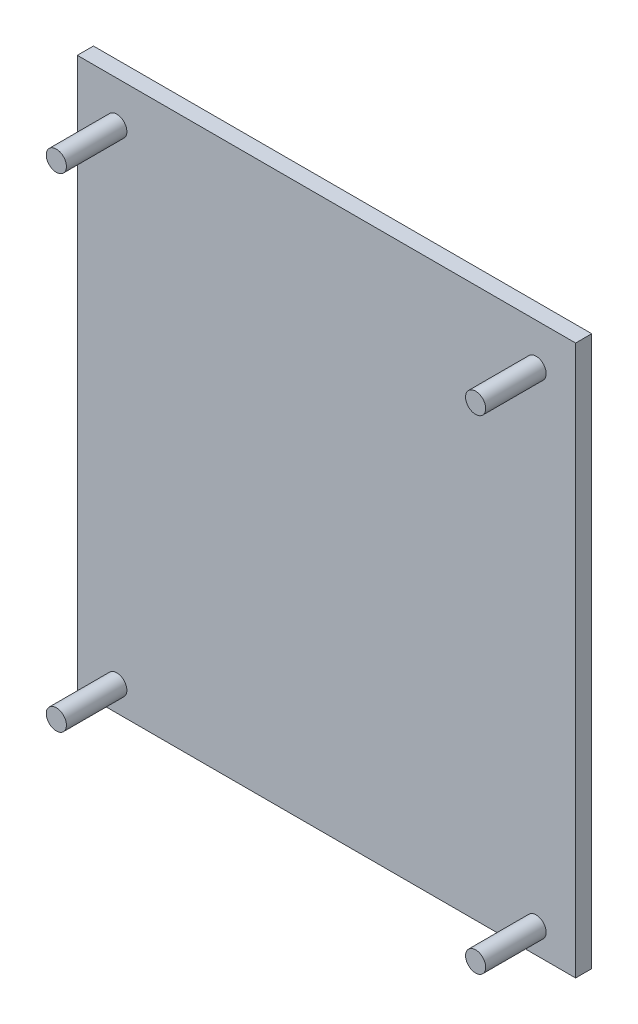
ISO-10303-21;
HEADER;
FILE_DESCRIPTION(('STEP AP214'),'2;1');
FILE_NAME('part.step','',(''),(''),'','','');
FILE_SCHEMA(('AUTOMOTIVE_DESIGN { 1 0 10303 214 1 1 1 1 }'));
ENDSEC;
DATA;
#1=APPLICATION_CONTEXT('core data for automotive mechanical design processes');
#2=APPLICATION_PROTOCOL_DEFINITION('international standard','automotive_design',2000,#1);
#3=PRODUCT_CONTEXT('',#1,'mechanical');
#4=PRODUCT('Part','Part','',(#3));
#5=PRODUCT_RELATED_PRODUCT_CATEGORY('part','',(#4));
#6=PRODUCT_DEFINITION_FORMATION('','',#4);
#7=PRODUCT_DEFINITION_CONTEXT('part definition',#1,'design');
#8=PRODUCT_DEFINITION('design','',#6,#7);
#9=PRODUCT_DEFINITION_SHAPE('','',#8);
#10=(LENGTH_UNIT() NAMED_UNIT(*) SI_UNIT(.MILLI.,.METRE.));
#11=(NAMED_UNIT(*) PLANE_ANGLE_UNIT() SI_UNIT($,.RADIAN.));
#12=(NAMED_UNIT(*) SI_UNIT($,.STERADIAN.) SOLID_ANGLE_UNIT());
#13=UNCERTAINTY_MEASURE_WITH_UNIT(LENGTH_MEASURE(1.E-05),#10,'distance_accuracy_value','');
#14=(GEOMETRIC_REPRESENTATION_CONTEXT(3) GLOBAL_UNCERTAINTY_ASSIGNED_CONTEXT((#13)) GLOBAL_UNIT_ASSIGNED_CONTEXT((#10,
#11,#12)) REPRESENTATION_CONTEXT('',''));
#15=CARTESIAN_POINT('',(0.,0.,0.));
#16=DIRECTION('',(0.,0.,1.));
#17=DIRECTION('',(1.,0.,0.));
#18=AXIS2_PLACEMENT_3D('',#15,#16,#17);
#19=CARTESIAN_POINT('',(0.,86.614,2.54));
#20=DIRECTION('',(1.,0.,0.));
#21=DIRECTION('',(0.,1.,0.));
#22=AXIS2_PLACEMENT_3D('',#19,#20,#21);
#23=PLANE('',#22);
#24=DIRECTION('',(0.,-1.,0.));
#25=VECTOR('',#24,1.);
#26=CARTESIAN_POINT('',(0.,86.614,0.));
#27=LINE('',#26,#25);
#28=CARTESIAN_POINT('',(0.,86.614,0.));
#29=VERTEX_POINT('',#28);
#30=CARTESIAN_POINT('',(0.,0.,0.));
#31=VERTEX_POINT('',#30);
#32=EDGE_CURVE('E95',#29,#31,#27,.T.);
#33=ORIENTED_EDGE('',*,*,#32,.T.);
#34=DIRECTION('',(0.,0.,-1.));
#35=VECTOR('',#34,1.);
#36=CARTESIAN_POINT('',(0.,0.,2.54));
#37=LINE('',#36,#35);
#38=CARTESIAN_POINT('',(0.,0.,2.54));
#39=VERTEX_POINT('',#38);
#40=EDGE_CURVE('E11',#39,#31,#37,.T.);
#41=ORIENTED_EDGE('',*,*,#40,.F.);
#42=DIRECTION('',(0.,-1.,0.));
#43=VECTOR('',#42,1.);
#44=CARTESIAN_POINT('',(0.,86.614,2.54));
#45=LINE('',#44,#43);
#46=CARTESIAN_POINT('',(0.,86.614,2.54));
#47=VERTEX_POINT('',#46);
#48=EDGE_CURVE('E83',#47,#39,#45,.T.);
#49=ORIENTED_EDGE('',*,*,#48,.F.);
#50=DIRECTION('',(0.,0.,-1.));
#51=VECTOR('',#50,1.);
#52=CARTESIAN_POINT('',(0.,86.614,2.54));
#53=LINE('',#52,#51);
#54=EDGE_CURVE('E91',#47,#29,#53,.T.);
#55=ORIENTED_EDGE('',*,*,#54,.T.);
#56=EDGE_LOOP('',(#33,#41,#49,#55));
#57=FACE_BOUND('',#56,.T.);
#58=ADVANCED_FACE('F32',(#57),#23,.F.);
#59=CARTESIAN_POINT('',(0.,0.,2.54));
#60=DIRECTION('',(0.,1.,0.));
#61=DIRECTION('',(-1.,0.,0.));
#62=AXIS2_PLACEMENT_3D('',#59,#60,#61);
#63=PLANE('',#62);
#64=DIRECTION('',(1.,0.,0.));
#65=VECTOR('',#64,1.);
#66=CARTESIAN_POINT('',(0.,0.,0.));
#67=LINE('',#66,#65);
#68=CARTESIAN_POINT('',(78.486,0.,0.));
#69=VERTEX_POINT('',#68);
#70=EDGE_CURVE('E87',#31,#69,#67,.T.);
#71=ORIENTED_EDGE('',*,*,#70,.T.);
#72=DIRECTION('',(0.,0.,-1.));
#73=VECTOR('',#72,1.);
#74=CARTESIAN_POINT('',(78.486,0.,2.54));
#75=LINE('',#74,#73);
#76=CARTESIAN_POINT('',(78.486,0.,2.54));
#77=VERTEX_POINT('',#76);
#78=EDGE_CURVE('E40',#77,#69,#75,.T.);
#79=ORIENTED_EDGE('',*,*,#78,.F.);
#80=DIRECTION('',(1.,0.,0.));
#81=VECTOR('',#80,1.);
#82=CARTESIAN_POINT('',(0.,0.,2.54));
#83=LINE('',#82,#81);
#84=EDGE_CURVE('E78',#39,#77,#83,.T.);
#85=ORIENTED_EDGE('',*,*,#84,.F.);
#86=ORIENTED_EDGE('',*,*,#40,.T.);
#87=EDGE_LOOP('',(#71,#79,#85,#86));
#88=FACE_BOUND('',#87,.T.);
#89=ADVANCED_FACE('F86',(#88),#63,.F.);
#90=CARTESIAN_POINT('',(78.486,86.614,2.54));
#91=DIRECTION('',(-1.,0.,0.));
#92=DIRECTION('',(0.,-1.,0.));
#93=AXIS2_PLACEMENT_3D('',#90,#91,#92);
#94=PLANE('',#93);
#95=DIRECTION('',(0.,1.,0.));
#96=VECTOR('',#95,1.);
#97=CARTESIAN_POINT('',(78.486,86.614,0.));
#98=LINE('',#97,#96);
#99=CARTESIAN_POINT('',(78.486,86.614,0.));
#100=VERTEX_POINT('',#99);
#101=EDGE_CURVE('E65',#69,#100,#98,.T.);
#102=ORIENTED_EDGE('',*,*,#101,.T.);
#103=DIRECTION('',(0.,0.,-1.));
#104=VECTOR('',#103,1.);
#105=CARTESIAN_POINT('',(78.486,86.614,2.54));
#106=LINE('',#105,#104);
#107=CARTESIAN_POINT('',(78.486,86.614,2.54));
#108=VERTEX_POINT('',#107);
#109=EDGE_CURVE('E88',#108,#100,#106,.T.);
#110=ORIENTED_EDGE('',*,*,#109,.F.);
#111=DIRECTION('',(0.,1.,0.));
#112=VECTOR('',#111,1.);
#113=CARTESIAN_POINT('',(78.486,86.614,2.54));
#114=LINE('',#113,#112);
#115=EDGE_CURVE('E81',#77,#108,#114,.T.);
#116=ORIENTED_EDGE('',*,*,#115,.F.);
#117=ORIENTED_EDGE('',*,*,#78,.T.);
#118=EDGE_LOOP('',(#102,#110,#116,#117));
#119=FACE_BOUND('',#118,.T.);
#120=ADVANCED_FACE('F89',(#119),#94,.F.);
#121=CARTESIAN_POINT('',(0.,86.614,2.54));
#122=DIRECTION('',(0.,-1.,0.));
#123=DIRECTION('',(1.,0.,0.));
#124=AXIS2_PLACEMENT_3D('',#121,#122,#123);
#125=PLANE('',#124);
#126=DIRECTION('',(-1.,0.,0.));
#127=VECTOR('',#126,1.);
#128=CARTESIAN_POINT('',(0.,86.614,0.));
#129=LINE('',#128,#127);
#130=EDGE_CURVE('E71',#100,#29,#129,.T.);
#131=ORIENTED_EDGE('',*,*,#130,.T.);
#132=ORIENTED_EDGE('',*,*,#54,.F.);
#133=DIRECTION('',(-1.,0.,0.));
#134=VECTOR('',#133,1.);
#135=CARTESIAN_POINT('',(0.,86.614,2.54));
#136=LINE('',#135,#134);
#137=EDGE_CURVE('E48',#108,#47,#136,.T.);
#138=ORIENTED_EDGE('',*,*,#137,.F.);
#139=ORIENTED_EDGE('',*,*,#109,.T.);
#140=EDGE_LOOP('',(#131,#132,#138,#139));
#141=FACE_BOUND('',#140,.T.);
#142=ADVANCED_FACE('F103',(#141),#125,.F.);
#143=CARTESIAN_POINT('',(0.,0.,2.54));
#144=DIRECTION('',(0.,0.,1.));
#145=DIRECTION('',(1.,0.,0.));
#146=AXIS2_PLACEMENT_3D('',#143,#144,#145);
#147=PLANE('',#146);
#148=CARTESIAN_POINT('',(6.22300000000004,3.91159999999997,2.54));
#149=DIRECTION('',(0.,0.,1.));
#150=DIRECTION('',(1.,0.,0.));
#151=AXIS2_PLACEMENT_3D('',#148,#149,#150);
#152=CIRCLE('',#151,1.58749999999999);
#153=CARTESIAN_POINT('',(7.81050000000003,3.91159999999997,2.54));
#154=VERTEX_POINT('',#153);
#155=EDGE_CURVE('E127',#154,#154,#152,.T.);
#156=ORIENTED_EDGE('',*,*,#155,.F.);
#157=EDGE_LOOP('',(#156));
#158=FACE_BOUND('',#157,.T.);
#159=CARTESIAN_POINT('',(72.263,3.91160000000003,2.54));
#160=DIRECTION('',(0.,0.,1.));
#161=DIRECTION('',(1.,0.,0.));
#162=AXIS2_PLACEMENT_3D('',#159,#160,#161);
#163=CIRCLE('',#162,1.5875);
#164=CARTESIAN_POINT('',(73.8505000000001,3.91160000000003,2.54));
#165=VERTEX_POINT('',#164);
#166=EDGE_CURVE('E121',#165,#165,#163,.T.);
#167=ORIENTED_EDGE('',*,*,#166,.F.);
#168=EDGE_LOOP('',(#167));
#169=FACE_BOUND('',#168,.T.);
#170=CARTESIAN_POINT('',(72.263,80.1116,2.54));
#171=DIRECTION('',(0.,0.,1.));
#172=DIRECTION('',(1.,0.,0.));
#173=AXIS2_PLACEMENT_3D('',#170,#171,#172);
#174=CIRCLE('',#173,1.58749999999999);
#175=CARTESIAN_POINT('',(73.8505,80.1116,2.54));
#176=VERTEX_POINT('',#175);
#177=EDGE_CURVE('E115',#176,#176,#174,.T.);
#178=ORIENTED_EDGE('',*,*,#177,.F.);
#179=EDGE_LOOP('',(#178));
#180=FACE_BOUND('',#179,.T.);
#181=CARTESIAN_POINT('',(6.22299999999997,80.1116,2.54));
#182=DIRECTION('',(0.,0.,1.));
#183=DIRECTION('',(1.,0.,0.));
#184=AXIS2_PLACEMENT_3D('',#181,#182,#183);
#185=CIRCLE('',#184,1.58749999999999);
#186=CARTESIAN_POINT('',(7.81049999999997,80.1116,2.54));
#187=VERTEX_POINT('',#186);
#188=EDGE_CURVE('E109',#187,#187,#185,.T.);
#189=ORIENTED_EDGE('',*,*,#188,.F.);
#190=EDGE_LOOP('',(#189));
#191=FACE_BOUND('',#190,.T.);
#192=ORIENTED_EDGE('',*,*,#48,.T.);
#193=ORIENTED_EDGE('',*,*,#84,.T.);
#194=ORIENTED_EDGE('',*,*,#115,.T.);
#195=ORIENTED_EDGE('',*,*,#137,.T.);
#196=EDGE_LOOP('',(#192,#193,#194,#195));
#197=FACE_BOUND('',#196,.T.);
#198=ADVANCED_FACE('F79',(#158,#169,#180,#191,#197),#147,.T.);
#199=CARTESIAN_POINT('',(0.,0.,0.));
#200=DIRECTION('',(0.,0.,1.));
#201=DIRECTION('',(1.,0.,0.));
#202=AXIS2_PLACEMENT_3D('',#199,#200,#201);
#203=PLANE('',#202);
#204=ORIENTED_EDGE('',*,*,#32,.F.);
#205=ORIENTED_EDGE('',*,*,#130,.F.);
#206=ORIENTED_EDGE('',*,*,#101,.F.);
#207=ORIENTED_EDGE('',*,*,#70,.F.);
#208=EDGE_LOOP('',(#204,#205,#206,#207));
#209=FACE_BOUND('',#208,.T.);
#210=ADVANCED_FACE('F106',(#209),#203,.F.);
#211=CARTESIAN_POINT('',(6.22299999999997,80.1116,12.065));
#212=DIRECTION('',(0.,0.,-1.));
#213=DIRECTION('',(-1.,0.,0.));
#214=AXIS2_PLACEMENT_3D('',#211,#212,#213);
#215=CYLINDRICAL_SURFACE('',#214,1.58749999999999);
#216=CARTESIAN_POINT('',(6.22299999999997,80.1116,12.065));
#217=DIRECTION('',(0.,0.,1.));
#218=DIRECTION('',(1.,0.,0.));
#219=AXIS2_PLACEMENT_3D('',#216,#217,#218);
#220=CIRCLE('',#219,1.58749999999999);
#221=CARTESIAN_POINT('',(7.81049999999997,80.1116,12.065));
#222=VERTEX_POINT('',#221);
#223=EDGE_CURVE('E98',#222,#222,#220,.T.);
#224=ORIENTED_EDGE('',*,*,#223,.F.);
#225=EDGE_LOOP('',(#224));
#226=FACE_BOUND('',#225,.T.);
#227=ORIENTED_EDGE('',*,*,#188,.T.);
#228=EDGE_LOOP('',(#227));
#229=FACE_BOUND('',#228,.T.);
#230=ADVANCED_FACE('F151',(#226,#229),#215,.T.);
#231=CARTESIAN_POINT('',(6.22299999999997,80.1116,12.065));
#232=DIRECTION('',(0.,0.,1.));
#233=DIRECTION('',(1.,0.,0.));
#234=AXIS2_PLACEMENT_3D('',#231,#232,#233);
#235=PLANE('',#234);
#236=ORIENTED_EDGE('',*,*,#223,.T.);
#237=EDGE_LOOP('',(#236));
#238=FACE_BOUND('',#237,.T.);
#239=ADVANCED_FACE('F153',(#238),#235,.T.);
#240=CARTESIAN_POINT('',(72.263,80.1116,12.065));
#241=DIRECTION('',(0.,0.,-1.));
#242=DIRECTION('',(-1.,0.,0.));
#243=AXIS2_PLACEMENT_3D('',#240,#241,#242);
#244=CYLINDRICAL_SURFACE('',#243,1.58749999999999);
#245=CARTESIAN_POINT('',(72.263,80.1116,12.065));
#246=DIRECTION('',(0.,0.,1.));
#247=DIRECTION('',(1.,0.,0.));
#248=AXIS2_PLACEMENT_3D('',#245,#246,#247);
#249=CIRCLE('',#248,1.58749999999999);
#250=CARTESIAN_POINT('',(73.8505,80.1116,12.065));
#251=VERTEX_POINT('',#250);
#252=EDGE_CURVE('E112',#251,#251,#249,.T.);
#253=ORIENTED_EDGE('',*,*,#252,.F.);
#254=EDGE_LOOP('',(#253));
#255=FACE_BOUND('',#254,.T.);
#256=ORIENTED_EDGE('',*,*,#177,.T.);
#257=EDGE_LOOP('',(#256));
#258=FACE_BOUND('',#257,.T.);
#259=ADVANCED_FACE('F160',(#255,#258),#244,.T.);
#260=CARTESIAN_POINT('',(72.263,80.1116,12.065));
#261=DIRECTION('',(0.,0.,1.));
#262=DIRECTION('',(1.,0.,0.));
#263=AXIS2_PLACEMENT_3D('',#260,#261,#262);
#264=PLANE('',#263);
#265=ORIENTED_EDGE('',*,*,#252,.T.);
#266=EDGE_LOOP('',(#265));
#267=FACE_BOUND('',#266,.T.);
#268=ADVANCED_FACE('F208',(#267),#264,.T.);
#269=CARTESIAN_POINT('',(72.263,3.91160000000003,12.065));
#270=DIRECTION('',(0.,0.,-1.));
#271=DIRECTION('',(-1.,0.,0.));
#272=AXIS2_PLACEMENT_3D('',#269,#270,#271);
#273=CYLINDRICAL_SURFACE('',#272,1.5875);
#274=CARTESIAN_POINT('',(72.263,3.91160000000003,12.065));
#275=DIRECTION('',(0.,0.,1.));
#276=DIRECTION('',(1.,0.,0.));
#277=AXIS2_PLACEMENT_3D('',#274,#275,#276);
#278=CIRCLE('',#277,1.5875);
#279=CARTESIAN_POINT('',(73.8505000000001,3.91160000000003,12.065));
#280=VERTEX_POINT('',#279);
#281=EDGE_CURVE('E118',#280,#280,#278,.T.);
#282=ORIENTED_EDGE('',*,*,#281,.F.);
#283=EDGE_LOOP('',(#282));
#284=FACE_BOUND('',#283,.T.);
#285=ORIENTED_EDGE('',*,*,#166,.T.);
#286=EDGE_LOOP('',(#285));
#287=FACE_BOUND('',#286,.T.);
#288=ADVANCED_FACE('F217',(#284,#287),#273,.T.);
#289=CARTESIAN_POINT('',(72.263,3.91160000000003,12.065));
#290=DIRECTION('',(0.,0.,1.));
#291=DIRECTION('',(1.,0.,0.));
#292=AXIS2_PLACEMENT_3D('',#289,#290,#291);
#293=PLANE('',#292);
#294=ORIENTED_EDGE('',*,*,#281,.T.);
#295=EDGE_LOOP('',(#294));
#296=FACE_BOUND('',#295,.T.);
#297=ADVANCED_FACE('F138',(#296),#293,.T.);
#298=CARTESIAN_POINT('',(6.22300000000004,3.91159999999997,12.065));
#299=DIRECTION('',(0.,0.,-1.));
#300=DIRECTION('',(-1.,0.,0.));
#301=AXIS2_PLACEMENT_3D('',#298,#299,#300);
#302=CYLINDRICAL_SURFACE('',#301,1.58749999999999);
#303=CARTESIAN_POINT('',(6.22300000000004,3.91159999999997,12.065));
#304=DIRECTION('',(0.,0.,1.));
#305=DIRECTION('',(1.,0.,0.));
#306=AXIS2_PLACEMENT_3D('',#303,#304,#305);
#307=CIRCLE('',#306,1.58749999999999);
#308=CARTESIAN_POINT('',(7.81050000000003,3.91159999999997,12.065));
#309=VERTEX_POINT('',#308);
#310=EDGE_CURVE('E124',#309,#309,#307,.T.);
#311=ORIENTED_EDGE('',*,*,#310,.F.);
#312=EDGE_LOOP('',(#311));
#313=FACE_BOUND('',#312,.T.);
#314=ORIENTED_EDGE('',*,*,#155,.T.);
#315=EDGE_LOOP('',(#314));
#316=FACE_BOUND('',#315,.T.);
#317=ADVANCED_FACE('F135',(#313,#316),#302,.T.);
#318=CARTESIAN_POINT('',(6.22300000000004,3.91159999999997,12.065));
#319=DIRECTION('',(0.,0.,1.));
#320=DIRECTION('',(1.,0.,0.));
#321=AXIS2_PLACEMENT_3D('',#318,#319,#320);
#322=PLANE('',#321);
#323=ORIENTED_EDGE('',*,*,#310,.T.);
#324=EDGE_LOOP('',(#323));
#325=FACE_BOUND('',#324,.T.);
#326=ADVANCED_FACE('F133',(#325),#322,.T.);
#327=CLOSED_SHELL('',(#58,#89,#120,#142,#198,#210,#230,#239,#259,#268,#288,#297,#317,#326));
#328=MANIFOLD_SOLID_BREP('B2',#327);
#329=ADVANCED_BREP_SHAPE_REPRESENTATION('',(#18,#328),#14);
#330=SHAPE_DEFINITION_REPRESENTATION(#9,#329);
ENDSEC;
END-ISO-10303-21;
